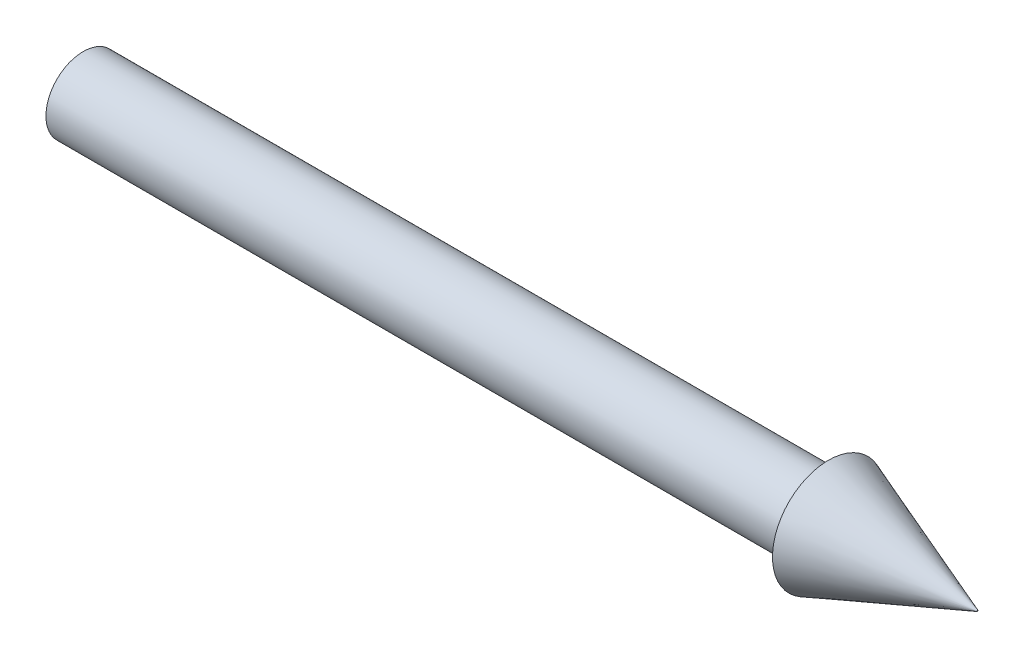
ISO-10303-21;
HEADER;
FILE_DESCRIPTION(('STEP AP214'),'2;1');
FILE_NAME('part.step','',(''),(''),'','','');
FILE_SCHEMA(('AUTOMOTIVE_DESIGN { 1 0 10303 214 1 1 1 1 }'));
ENDSEC;
DATA;
#1=APPLICATION_CONTEXT('core data for automotive mechanical design processes');
#2=APPLICATION_PROTOCOL_DEFINITION('international standard','automotive_design',2000,#1);
#3=PRODUCT_CONTEXT('',#1,'mechanical');
#4=PRODUCT('Part','Part','',(#3));
#5=PRODUCT_RELATED_PRODUCT_CATEGORY('part','',(#4));
#6=PRODUCT_DEFINITION_FORMATION('','',#4);
#7=PRODUCT_DEFINITION_CONTEXT('part definition',#1,'design');
#8=PRODUCT_DEFINITION('design','',#6,#7);
#9=PRODUCT_DEFINITION_SHAPE('','',#8);
#10=(LENGTH_UNIT() NAMED_UNIT(*) SI_UNIT(.MILLI.,.METRE.));
#11=(NAMED_UNIT(*) PLANE_ANGLE_UNIT() SI_UNIT($,.RADIAN.));
#12=(NAMED_UNIT(*) SI_UNIT($,.STERADIAN.) SOLID_ANGLE_UNIT());
#13=UNCERTAINTY_MEASURE_WITH_UNIT(LENGTH_MEASURE(1.E-05),#10,'distance_accuracy_value','');
#14=(GEOMETRIC_REPRESENTATION_CONTEXT(3) GLOBAL_UNCERTAINTY_ASSIGNED_CONTEXT((#13)) GLOBAL_UNIT_ASSIGNED_CONTEXT((#10,
#11,#12)) REPRESENTATION_CONTEXT('',''));
#15=CARTESIAN_POINT('',(0.,0.,0.));
#16=DIRECTION('',(0.,0.,1.));
#17=DIRECTION('',(1.,0.,0.));
#18=AXIS2_PLACEMENT_3D('',#15,#16,#17);
#19=CARTESIAN_POINT('',(127.,0.,0.));
#20=DIRECTION('',(-1.,0.,0.));
#21=DIRECTION('',(0.,0.,1.));
#22=AXIS2_PLACEMENT_3D('',#19,#20,#21);
#23=CYLINDRICAL_SURFACE('',#22,12.7);
#24=CARTESIAN_POINT('',(127.,0.,0.));
#25=DIRECTION('',(1.,0.,0.));
#26=DIRECTION('',(0.,0.,-1.));
#27=AXIS2_PLACEMENT_3D('',#24,#25,#26);
#28=CIRCLE('',#27,12.7);
#29=CARTESIAN_POINT('',(127.,0.,-12.7));
#30=VERTEX_POINT('',#29);
#31=EDGE_CURVE('E11',#30,#30,#28,.T.);
#32=ORIENTED_EDGE('',*,*,#31,.F.);
#33=EDGE_LOOP('',(#32));
#34=FACE_BOUND('',#33,.T.);
#35=CARTESIAN_POINT('',(-127.,0.,0.));
#36=DIRECTION('',(1.,0.,0.));
#37=DIRECTION('',(0.,0.,-1.));
#38=AXIS2_PLACEMENT_3D('',#35,#36,#37);
#39=CIRCLE('',#38,12.7);
#40=CARTESIAN_POINT('',(-127.,0.,-12.7));
#41=VERTEX_POINT('',#40);
#42=EDGE_CURVE('E39',#41,#41,#39,.T.);
#43=ORIENTED_EDGE('',*,*,#42,.T.);
#44=EDGE_LOOP('',(#43));
#45=FACE_BOUND('',#44,.T.);
#46=ADVANCED_FACE('F36',(#34,#45),#23,.T.);
#47=CARTESIAN_POINT('',(-127.,0.,0.));
#48=DIRECTION('',(1.,0.,0.));
#49=DIRECTION('',(0.,0.,-1.));
#50=AXIS2_PLACEMENT_3D('',#47,#48,#49);
#51=PLANE('',#50);
#52=ORIENTED_EDGE('',*,*,#42,.F.);
#53=EDGE_LOOP('',(#52));
#54=FACE_BOUND('',#53,.T.);
#55=ADVANCED_FACE('F72',(#54),#51,.F.);
#56=CARTESIAN_POINT('',(127.,0.,0.));
#57=DIRECTION('',(1.,0.,0.));
#58=DIRECTION('',(0.,0.,-1.));
#59=AXIS2_PLACEMENT_3D('',#56,#57,#58);
#60=PLANE('',#59);
#61=CARTESIAN_POINT('',(127.,0.,0.));
#62=DIRECTION('',(1.,0.,0.));
#63=DIRECTION('',(0.,0.,-1.));
#64=AXIS2_PLACEMENT_3D('',#61,#62,#63);
#65=CIRCLE('',#64,19.05);
#66=CARTESIAN_POINT('',(127.,0.,-19.05));
#67=VERTEX_POINT('',#66);
#68=EDGE_CURVE('E46',#67,#67,#65,.T.);
#69=ORIENTED_EDGE('',*,*,#68,.F.);
#70=EDGE_LOOP('',(#69));
#71=FACE_BOUND('',#70,.T.);
#72=ORIENTED_EDGE('',*,*,#31,.T.);
#73=EDGE_LOOP('',(#72));
#74=FACE_BOUND('',#73,.T.);
#75=ADVANCED_FACE('F68',(#71,#74),#60,.F.);
#76=CARTESIAN_POINT('',(177.8,0.,0.));
#77=DIRECTION('',(1.,0.,0.));
#78=DIRECTION('',(0.,0.,-1.));
#79=AXIS2_PLACEMENT_3D('',#76,#77,#78);
#80=PLANE('',#79);
#81=CARTESIAN_POINT('',(177.8,0.,0.));
#82=DIRECTION('',(1.,0.,0.));
#83=DIRECTION('',(0.,0.,-1.));
#84=AXIS2_PLACEMENT_3D('',#81,#82,#83);
#85=CIRCLE('',#84,0.1984375);
#86=CARTESIAN_POINT('',(177.8,0.,-0.1984375));
#87=VERTEX_POINT('',#86);
#88=EDGE_CURVE('E50',#87,#87,#85,.T.);
#89=ORIENTED_EDGE('',*,*,#88,.T.);
#90=EDGE_LOOP('',(#89));
#91=FACE_BOUND('',#90,.T.);
#92=ADVANCED_FACE('F58',(#91),#80,.T.);
#93=CARTESIAN_POINT('',(177.8,0.,0.));
#94=DIRECTION('',(-1.,0.,0.));
#95=DIRECTION('',(0.,0.,1.));
#96=AXIS2_PLACEMENT_3D('',#93,#94,#95);
#97=CONICAL_SURFACE('',#96,0.1984375,0.355341622416168);
#98=ORIENTED_EDGE('',*,*,#68,.T.);
#99=EDGE_LOOP('',(#98));
#100=FACE_BOUND('',#99,.T.);
#101=ORIENTED_EDGE('',*,*,#88,.F.);
#102=EDGE_LOOP('',(#101));
#103=FACE_BOUND('',#102,.T.);
#104=ADVANCED_FACE('F67',(#100,#103),#97,.T.);
#105=CLOSED_SHELL('',(#46,#55,#75,#92,#104));
#106=MANIFOLD_SOLID_BREP('B2',#105);
#107=ADVANCED_BREP_SHAPE_REPRESENTATION('',(#18,#106),#14);
#108=SHAPE_DEFINITION_REPRESENTATION(#9,#107);
ENDSEC;
END-ISO-10303-21;
